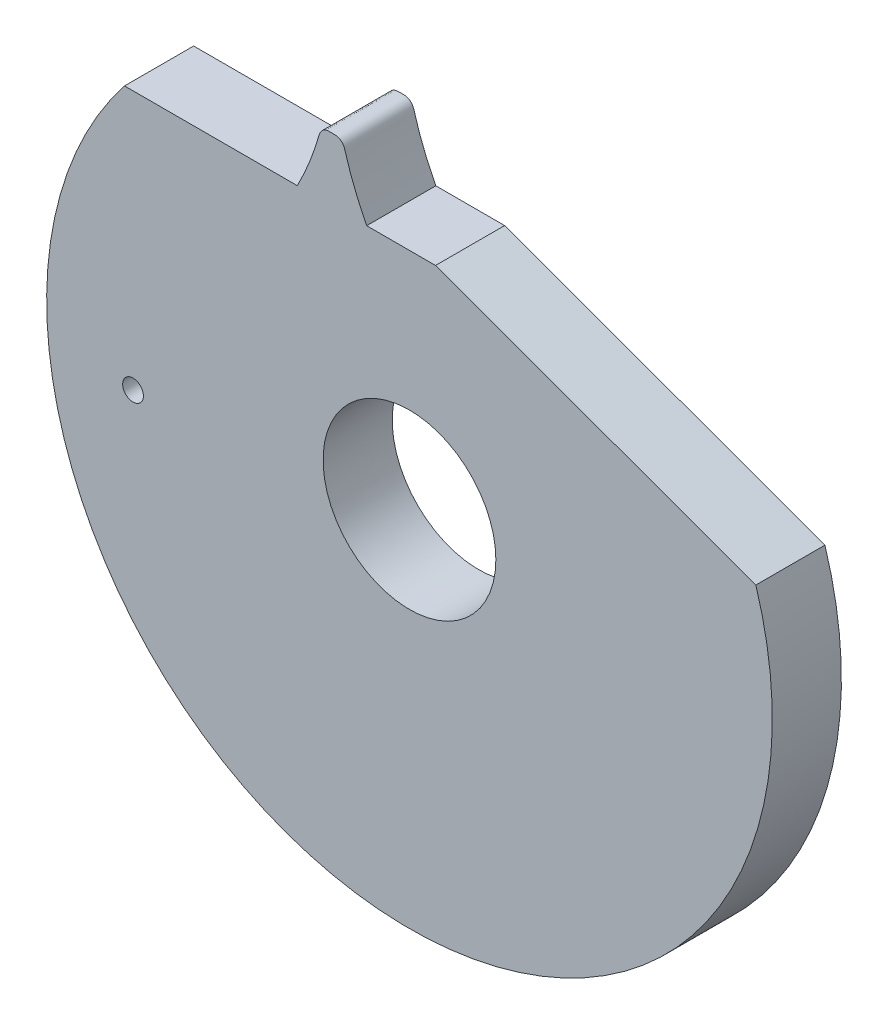
ISO-10303-21;
HEADER;
FILE_DESCRIPTION(('STEP AP214'),'2;1');
FILE_NAME('part.step','',(''),(''),'','','');
FILE_SCHEMA(('AUTOMOTIVE_DESIGN { 1 0 10303 214 1 1 1 1 }'));
ENDSEC;
DATA;
#1=APPLICATION_CONTEXT('core data for automotive mechanical design processes');
#2=APPLICATION_PROTOCOL_DEFINITION('international standard','automotive_design',2000,#1);
#3=PRODUCT_CONTEXT('',#1,'mechanical');
#4=PRODUCT('Part','Part','',(#3));
#5=PRODUCT_RELATED_PRODUCT_CATEGORY('part','',(#4));
#6=PRODUCT_DEFINITION_FORMATION('','',#4);
#7=PRODUCT_DEFINITION_CONTEXT('part definition',#1,'design');
#8=PRODUCT_DEFINITION('design','',#6,#7);
#9=PRODUCT_DEFINITION_SHAPE('','',#8);
#10=(LENGTH_UNIT() NAMED_UNIT(*) SI_UNIT(.MILLI.,.METRE.));
#11=(NAMED_UNIT(*) PLANE_ANGLE_UNIT() SI_UNIT($,.RADIAN.));
#12=(NAMED_UNIT(*) SI_UNIT($,.STERADIAN.) SOLID_ANGLE_UNIT());
#13=UNCERTAINTY_MEASURE_WITH_UNIT(LENGTH_MEASURE(1.E-05),#10,'distance_accuracy_value','');
#14=(GEOMETRIC_REPRESENTATION_CONTEXT(3) GLOBAL_UNCERTAINTY_ASSIGNED_CONTEXT((#13)) GLOBAL_UNIT_ASSIGNED_CONTEXT((#10,
#11,#12)) REPRESENTATION_CONTEXT('',''));
#15=CARTESIAN_POINT('',(0.,0.,0.));
#16=DIRECTION('',(0.,0.,1.));
#17=DIRECTION('',(1.,0.,0.));
#18=AXIS2_PLACEMENT_3D('',#15,#16,#17);
#19=CARTESIAN_POINT('',(-0.560560129400888,2.07992567827172,0.5));
#20=DIRECTION('',(0.,0.,-1.));
#21=DIRECTION('',(-1.,0.,0.));
#22=AXIS2_PLACEMENT_3D('',#19,#20,#21);
#23=PLANE('',#22);
#24=CARTESIAN_POINT('',(0.,0.,0.5));
#25=DIRECTION('',(0.,0.,1.));
#26=DIRECTION('',(1.,0.,0.));
#27=AXIS2_PLACEMENT_3D('',#24,#25,#26);
#28=CIRCLE('',#27,0.625);
#29=CARTESIAN_POINT('',(0.625,0.,0.5));
#30=VERTEX_POINT('',#29);
#31=EDGE_CURVE('E116',#30,#30,#28,.T.);
#32=ORIENTED_EDGE('',*,*,#31,.F.);
#33=EDGE_LOOP('',(#32));
#34=FACE_BOUND('',#33,.T.);
#35=CARTESIAN_POINT('',(-0.309567445992937,1.625,0.5));
#36=CARTESIAN_POINT('',(-0.322337903018578,1.64995934930982,0.5));
#37=CARTESIAN_POINT('',(-0.338622020565531,1.68309087865979,0.5));
#38=CARTESIAN_POINT('',(-0.35777313286631,1.7244231603822,0.5));
#39=CARTESIAN_POINT('',(-0.36840810968514,1.74806485199601,0.5));
#40=CARTESIAN_POINT('',(-0.378496488941134,1.77117838096723,0.5));
#41=CARTESIAN_POINT('',(-0.388051433653411,1.79375455928541,0.5));
#42=CARTESIAN_POINT('',(-0.397086252348211,1.81578443212939,0.5));
#43=CARTESIAN_POINT('',(-0.405614380501074,1.8372592751375,0.5));
#44=CARTESIAN_POINT('',(-0.413649395880378,1.85817059330962,0.5));
#45=CARTESIAN_POINT('',(-0.421204956877051,1.87851013821923,0.5));
#46=CARTESIAN_POINT('',(-0.428295003470919,1.89826985361319,0.5));
#47=CARTESIAN_POINT('',(-0.434933028025355,1.91744207676664,0.5));
#48=CARTESIAN_POINT('',(-0.441134643880046,1.93601883222484,0.5));
#49=CARTESIAN_POINT('',(-0.446908480166645,1.953994338277,0.5));
#50=CARTESIAN_POINT('',(-0.452288320773321,1.97135616236044,0.5));
#51=CARTESIAN_POINT('',(-0.457709999111133,1.98978229839919,0.5));
#52=CARTESIAN_POINT('',(-0.461829216383996,2.00376157330081,0.5));
#53=CARTESIAN_POINT('',(-0.464382168712026,2.01359325376766,0.5));
#54=CARTESIAN_POINT('',(-0.465582908789986,2.01765593246769,0.5));
#55=CARTESIAN_POINT('',(-0.466877066839506,2.02167416661449,0.5));
#56=CARTESIAN_POINT('',(-0.468293534704594,2.02566287292413,0.5));
#57=CARTESIAN_POINT('',(-0.469851220014418,2.02964414127735,0.5));
#58=CARTESIAN_POINT('',(-0.471580695855447,2.0336424151051,0.5));
#59=CARTESIAN_POINT('',(-0.473521601000363,2.03768594156605,0.5));
#60=CARTESIAN_POINT('',(-0.47572772760842,2.04180590116188,0.5));
#61=CARTESIAN_POINT('',(-0.47827146638032,2.04603482702129,0.5));
#62=CARTESIAN_POINT('',(-0.481249978189814,2.05040257909694,0.5));
#63=CARTESIAN_POINT('',(-0.484791874836422,2.05492815242703,0.5));
#64=CARTESIAN_POINT('',(-0.489062458870084,2.05960434758713,0.5));
#65=CARTESIAN_POINT('',(-0.494262133878477,2.06437232821557,0.5));
#66=CARTESIAN_POINT('',(-0.50060726050232,2.06908401040865,0.5));
#67=CARTESIAN_POINT('',(-0.508278836120168,2.07346637086148,0.5));
#68=CARTESIAN_POINT('',(-0.517327269196836,2.0770926129763,0.5));
#69=CARTESIAN_POINT('',(-0.527245490372485,2.0794312431513,0.5));
#70=CARTESIAN_POINT('',(-0.541824753831042,2.08034754096189,0.5));
#71=CARTESIAN_POINT('',(-0.560560129400889,2.07963200688566,0.5));
#72=CARTESIAN_POINT('',(-0.579295504970736,2.08034754096189,0.5));
#73=CARTESIAN_POINT('',(-0.593874768429294,2.0794312431513,0.5));
#74=CARTESIAN_POINT('',(-0.603792989604942,2.0770926129763,0.5));
#75=CARTESIAN_POINT('',(-0.61284142268161,2.07346637086148,0.5));
#76=CARTESIAN_POINT('',(-0.620512998299459,2.06908401040865,0.5));
#77=CARTESIAN_POINT('',(-0.6268581249233,2.06437232821558,0.5));
#78=CARTESIAN_POINT('',(-0.632057799931697,2.05960434758714,0.5));
#79=CARTESIAN_POINT('',(-0.636328383965352,2.05492815242702,0.5));
#80=CARTESIAN_POINT('',(-0.63987028061197,2.05040257909694,0.5));
#81=CARTESIAN_POINT('',(-0.642848792421458,2.04603482702129,0.5));
#82=CARTESIAN_POINT('',(-0.645392531193359,2.04180590116188,0.5));
#83=CARTESIAN_POINT('',(-0.647598657801414,2.03768594156605,0.5));
#84=CARTESIAN_POINT('',(-0.649539562946333,2.0336424151051,0.5));
#85=CARTESIAN_POINT('',(-0.651269038787359,2.02964414127735,0.5));
#86=CARTESIAN_POINT('',(-0.652826724097191,2.02566287292414,0.5));
#87=CARTESIAN_POINT('',(-0.654243191962271,2.02167416661449,0.5));
#88=CARTESIAN_POINT('',(-0.655537350011793,2.01765593246769,0.5));
#89=CARTESIAN_POINT('',(-0.656738090089753,2.01359325376767,0.5));
#90=CARTESIAN_POINT('',(-0.659291042417784,2.00376157330082,0.5));
#91=CARTESIAN_POINT('',(-0.663410259690648,1.98978229839919,0.5));
#92=CARTESIAN_POINT('',(-0.66883193802845,1.97135616236044,0.5));
#93=CARTESIAN_POINT('',(-0.67421177863514,1.953994338277,0.5));
#94=CARTESIAN_POINT('',(-0.679985614921724,1.93601883222484,0.5));
#95=CARTESIAN_POINT('',(-0.686187230776425,1.91744207676663,0.5));
#96=CARTESIAN_POINT('',(-0.692825255330861,1.89826985361319,0.5));
#97=CARTESIAN_POINT('',(-0.699915301924726,1.87851013821923,0.5));
#98=CARTESIAN_POINT('',(-0.707470862921397,1.85817059330961,0.5));
#99=CARTESIAN_POINT('',(-0.715505878300701,1.83725927513749,0.5));
#100=CARTESIAN_POINT('',(-0.724034006453567,1.81578443212938,0.5));
#101=CARTESIAN_POINT('',(-0.733068825148353,1.7937545592854,0.5));
#102=CARTESIAN_POINT('',(-0.742623769860647,1.77117838096723,0.5));
#103=CARTESIAN_POINT('',(-0.752712149116627,1.74806485199601,0.5));
#104=CARTESIAN_POINT('',(-0.763347125935458,1.7244231603822,0.5));
#105=CARTESIAN_POINT('',(-0.782498238236236,1.68309087865979,0.5));
#106=CARTESIAN_POINT('',(-0.798782355783188,1.64995934930982,0.5));
#107=CARTESIAN_POINT('',(-0.811552812808832,1.625,0.5));
#108=B_SPLINE_CURVE_WITH_KNOTS('',3,(#35,#36,#37,#38,#39,#40,#41,#42,#43,#44,#45,#46,#47,#48,
#49,#50,#51,#52,#53,#54,#55,#56,#57,#58,#59,#60,#61,#62,#63,#64,#65,#66,#67,#68,#69,#70,#71,#72,
#73,#74,#75,#76,#77,#78,#79,#80,#81,#82,#83,#84,#85,#86,#87,#88,#89,#90,#91,#92,#93,#94,#95,#96,
#97,#98,#99,#100,#101,#102,#103,#104,#105,#106,#107),.UNSPECIFIED.,.F.,.F.,(4,1,1,1,1,1,1,1,1,1,
1,1,1,1,1,1,1,1,1,1,1,1,1,1,1,1,1,1,1,1,1,1,1,1,1,1,1,1,1,1,1,1,1,1,1,1,1,1,1,1,1,1,1,1,1,1,1,1,
1,1,1,1,1,1,1,1,1,1,1,1,4),(0.,0.0766434706907742,0.100907917309995,0.124530540841739,
0.147511341286021,0.16985031864285,0.191547472912244,0.212602804094209,0.233016312188767,
0.252787997195939,0.271917859115733,0.290405897948182,0.308252113693299,0.325456506351118,
0.34201907592166,0.357939822404965,0.377966123851803,0.381853223429495,0.385706750251701,
0.389545590933468,0.393392716060458,0.397276239563091,0.401230769159746,0.405299107363362,
0.409534341124745,0.414002283313193,0.4187840362205,0.423978013917385,0.42969988880457,
0.436077404659656,0.443234951367286,0.451261729603674,0.460161640974881,0.469798585148513,
0.478975881094316,0.5,0.521024118905687,0.53020141485149,0.539838359025121,0.548738270396328,
0.556765048632712,0.563922595340345,0.57030011119543,0.576021986082618,0.581215963779502,
0.585997716686808,0.590465658875256,0.594700892636639,0.598769230840255,0.60272376043691,
0.606607283939544,0.610454409066533,0.614293249748303,0.618146776570508,0.622033876148198,
0.642060177595036,0.657980924078343,0.674543493648883,0.69174788630671,0.709594102051831,
0.728082140884274,0.747212002804071,0.766983687811239,0.787397195905797,0.808452527087764,
0.830149681357157,0.852488658713985,0.875469459158265,0.899092082690012,0.923356529309232,1.),.UNSPECIFIED.);
#109=CARTESIAN_POINT('',(-0.309567445992937,1.625,0.5));
#110=VERTEX_POINT('',#109);
#111=CARTESIAN_POINT('',(-0.811552812808832,1.625,0.5));
#112=VERTEX_POINT('',#111);
#113=EDGE_CURVE('E124',#110,#112,#108,.T.);
#114=ORIENTED_EDGE('',*,*,#113,.T.);
#115=DIRECTION('',(-1.,0.,0.));
#116=VECTOR('',#115,1.);
#117=CARTESIAN_POINT('',(-2.06155281280883,1.625,0.5));
#118=LINE('',#117,#116);
#119=CARTESIAN_POINT('',(-2.06155281280883,1.625,0.5));
#120=VERTEX_POINT('',#119);
#121=EDGE_CURVE('E86',#112,#120,#118,.T.);
#122=ORIENTED_EDGE('',*,*,#121,.T.);
#123=CARTESIAN_POINT('',(0.,0.,0.5));
#124=DIRECTION('',(0.,0.,1.));
#125=DIRECTION('',(1.,0.,0.));
#126=AXIS2_PLACEMENT_3D('',#123,#124,#125);
#127=CIRCLE('',#126,2.625);
#128=CARTESIAN_POINT('',(2.50597262834034,0.781489722267049,0.5));
#129=VERTEX_POINT('',#128);
#130=EDGE_CURVE('E90',#120,#129,#127,.T.);
#131=ORIENTED_EDGE('',*,*,#130,.T.);
#132=DIRECTION('',(-0.939692620785908,0.34202014332567,0.));
#133=VECTOR('',#132,1.);
#134=CARTESIAN_POINT('',(0.188447187191166,1.625,0.5));
#135=LINE('',#134,#133);
#136=CARTESIAN_POINT('',(0.188447187191166,1.625,0.5));
#137=VERTEX_POINT('',#136);
#138=EDGE_CURVE('E94',#129,#137,#135,.T.);
#139=ORIENTED_EDGE('',*,*,#138,.T.);
#140=DIRECTION('',(-1.,0.,0.));
#141=VECTOR('',#140,1.);
#142=CARTESIAN_POINT('',(-0.309567445992937,1.625,0.5));
#143=LINE('',#142,#141);
#144=EDGE_CURVE('E52',#137,#110,#143,.T.);
#145=ORIENTED_EDGE('',*,*,#144,.T.);
#146=EDGE_LOOP('',(#114,#122,#131,#139,#145));
#147=FACE_BOUND('',#146,.T.);
#148=CARTESIAN_POINT('',(-2.,-0.250000000000002,0.5));
#149=DIRECTION('',(0.,0.,1.));
#150=DIRECTION('',(1.,0.,0.));
#151=AXIS2_PLACEMENT_3D('',#148,#149,#150);
#152=CIRCLE('',#151,0.075);
#153=CARTESIAN_POINT('',(-1.925,-0.250000000000002,0.5));
#154=VERTEX_POINT('',#153);
#155=EDGE_CURVE('E162',#154,#154,#152,.T.);
#156=ORIENTED_EDGE('',*,*,#155,.F.);
#157=EDGE_LOOP('',(#156));
#158=FACE_BOUND('',#157,.T.);
#159=ADVANCED_FACE('F34',(#34,#147,#158),#23,.F.);
#160=CARTESIAN_POINT('',(-0.560560129400888,2.07992567827172,0.));
#161=DIRECTION('',(0.,0.,-1.));
#162=DIRECTION('',(-1.,0.,0.));
#163=AXIS2_PLACEMENT_3D('',#160,#161,#162);
#164=PLANE('',#163);
#165=CARTESIAN_POINT('',(0.,0.,0.));
#166=DIRECTION('',(0.,0.,1.));
#167=DIRECTION('',(1.,0.,0.));
#168=AXIS2_PLACEMENT_3D('',#165,#166,#167);
#169=CIRCLE('',#168,0.625);
#170=CARTESIAN_POINT('',(0.625,0.,0.));
#171=VERTEX_POINT('',#170);
#172=EDGE_CURVE('E167',#171,#171,#169,.T.);
#173=ORIENTED_EDGE('',*,*,#172,.T.);
#174=EDGE_LOOP('',(#173));
#175=FACE_BOUND('',#174,.T.);
#176=CARTESIAN_POINT('',(-0.309567445992937,1.625,0.));
#177=CARTESIAN_POINT('',(-0.322337903018578,1.64995934930982,0.));
#178=CARTESIAN_POINT('',(-0.33862202056553,1.68309087865979,0.));
#179=CARTESIAN_POINT('',(-0.35777313286631,1.7244231603822,0.));
#180=CARTESIAN_POINT('',(-0.36840810968514,1.74806485199601,0.));
#181=CARTESIAN_POINT('',(-0.378496488941135,1.77117838096723,0.));
#182=CARTESIAN_POINT('',(-0.388051433653411,1.79375455928541,0.));
#183=CARTESIAN_POINT('',(-0.397086252348211,1.81578443212939,0.));
#184=CARTESIAN_POINT('',(-0.405614380501074,1.8372592751375,0.));
#185=CARTESIAN_POINT('',(-0.413649395880379,1.85817059330962,0.));
#186=CARTESIAN_POINT('',(-0.421204956877051,1.87851013821923,0.));
#187=CARTESIAN_POINT('',(-0.42829500347092,1.89826985361319,0.));
#188=CARTESIAN_POINT('',(-0.434933028025354,1.91744207676664,0.));
#189=CARTESIAN_POINT('',(-0.441134643880047,1.93601883222484,0.));
#190=CARTESIAN_POINT('',(-0.446908480166645,1.953994338277,0.));
#191=CARTESIAN_POINT('',(-0.452288320773321,1.97135616236044,0.));
#192=CARTESIAN_POINT('',(-0.457709999111133,1.98978229839919,0.));
#193=CARTESIAN_POINT('',(-0.461829216383996,2.00376157330081,0.));
#194=CARTESIAN_POINT('',(-0.464382168712026,2.01359325376766,0.));
#195=CARTESIAN_POINT('',(-0.465582908789986,2.01765593246769,0.));
#196=CARTESIAN_POINT('',(-0.466877066839507,2.02167416661449,0.));
#197=CARTESIAN_POINT('',(-0.468293534704594,2.02566287292413,0.));
#198=CARTESIAN_POINT('',(-0.469851220014418,2.02964414127735,0.));
#199=CARTESIAN_POINT('',(-0.471580695855446,2.0336424151051,0.));
#200=CARTESIAN_POINT('',(-0.473521601000363,2.03768594156605,0.));
#201=CARTESIAN_POINT('',(-0.47572772760842,2.04180590116188,0.));
#202=CARTESIAN_POINT('',(-0.47827146638032,2.04603482702129,0.));
#203=CARTESIAN_POINT('',(-0.481249978189814,2.05040257909694,0.));
#204=CARTESIAN_POINT('',(-0.484791874836423,2.05492815242703,0.));
#205=CARTESIAN_POINT('',(-0.489062458870084,2.05960434758713,0.));
#206=CARTESIAN_POINT('',(-0.494262133878477,2.06437232821557,0.));
#207=CARTESIAN_POINT('',(-0.500607260502319,2.06908401040865,0.));
#208=CARTESIAN_POINT('',(-0.508278836120168,2.07346637086148,0.));
#209=CARTESIAN_POINT('',(-0.517327269196836,2.0770926129763,0.));
#210=CARTESIAN_POINT('',(-0.527245490372485,2.0794312431513,0.));
#211=CARTESIAN_POINT('',(-0.541824753831043,2.08034754096189,0.));
#212=CARTESIAN_POINT('',(-0.560560129400888,2.07963200688566,0.));
#213=CARTESIAN_POINT('',(-0.579295504970736,2.08034754096189,0.));
#214=CARTESIAN_POINT('',(-0.593874768429294,2.0794312431513,0.));
#215=CARTESIAN_POINT('',(-0.603792989604942,2.0770926129763,0.));
#216=CARTESIAN_POINT('',(-0.61284142268161,2.07346637086148,0.));
#217=CARTESIAN_POINT('',(-0.620512998299458,2.06908401040865,0.));
#218=CARTESIAN_POINT('',(-0.6268581249233,2.06437232821558,0.));
#219=CARTESIAN_POINT('',(-0.632057799931697,2.05960434758714,0.));
#220=CARTESIAN_POINT('',(-0.636328383965352,2.05492815242702,0.));
#221=CARTESIAN_POINT('',(-0.639870280611971,2.05040257909694,0.));
#222=CARTESIAN_POINT('',(-0.642848792421457,2.04603482702129,0.));
#223=CARTESIAN_POINT('',(-0.645392531193359,2.04180590116188,0.));
#224=CARTESIAN_POINT('',(-0.647598657801415,2.03768594156605,0.));
#225=CARTESIAN_POINT('',(-0.649539562946332,2.0336424151051,0.));
#226=CARTESIAN_POINT('',(-0.65126903878736,2.02964414127735,0.));
#227=CARTESIAN_POINT('',(-0.652826724097191,2.02566287292414,0.));
#228=CARTESIAN_POINT('',(-0.654243191962272,2.02167416661449,0.));
#229=CARTESIAN_POINT('',(-0.655537350011793,2.01765593246769,0.));
#230=CARTESIAN_POINT('',(-0.656738090089753,2.01359325376767,0.));
#231=CARTESIAN_POINT('',(-0.659291042417784,2.00376157330082,0.));
#232=CARTESIAN_POINT('',(-0.663410259690648,1.98978229839919,0.));
#233=CARTESIAN_POINT('',(-0.668831938028451,1.97135616236044,0.));
#234=CARTESIAN_POINT('',(-0.67421177863514,1.953994338277,0.));
#235=CARTESIAN_POINT('',(-0.679985614921725,1.93601883222484,0.));
#236=CARTESIAN_POINT('',(-0.686187230776424,1.91744207676663,0.));
#237=CARTESIAN_POINT('',(-0.692825255330861,1.89826985361319,0.));
#238=CARTESIAN_POINT('',(-0.699915301924727,1.87851013821923,0.));
#239=CARTESIAN_POINT('',(-0.707470862921397,1.85817059330961,0.));
#240=CARTESIAN_POINT('',(-0.715505878300702,1.83725927513749,0.));
#241=CARTESIAN_POINT('',(-0.724034006453567,1.81578443212938,0.));
#242=CARTESIAN_POINT('',(-0.733068825148352,1.7937545592854,0.));
#243=CARTESIAN_POINT('',(-0.742623769860647,1.77117838096723,0.));
#244=CARTESIAN_POINT('',(-0.752712149116627,1.74806485199601,0.));
#245=CARTESIAN_POINT('',(-0.763347125935458,1.7244231603822,0.));
#246=CARTESIAN_POINT('',(-0.782498238236238,1.68309087865978,0.));
#247=CARTESIAN_POINT('',(-0.798782355783187,1.64995934930982,0.));
#248=CARTESIAN_POINT('',(-0.811552812808832,1.625,0.));
#249=B_SPLINE_CURVE_WITH_KNOTS('',3,(#176,#177,#178,#179,#180,#181,#182,#183,#184,#185,#186,
#187,#188,#189,#190,#191,#192,#193,#194,#195,#196,#197,#198,#199,#200,#201,#202,#203,#204,#205,
#206,#207,#208,#209,#210,#211,#212,#213,#214,#215,#216,#217,#218,#219,#220,#221,#222,#223,#224,
#225,#226,#227,#228,#229,#230,#231,#232,#233,#234,#235,#236,#237,#238,#239,#240,#241,#242,#243,
#244,#245,#246,#247,#248),.UNSPECIFIED.,.F.,.F.,(4,1,1,1,1,1,1,1,1,1,1,1,1,1,1,1,1,1,1,1,1,1,1,
1,1,1,1,1,1,1,1,1,1,1,1,1,1,1,1,1,1,1,1,1,1,1,1,1,1,1,1,1,1,1,1,1,1,1,1,1,1,1,1,1,1,1,1,1,1,1,
4),(0.,0.0766434706907742,0.100907917309995,0.124530540841739,0.147511341286021,
0.16985031864285,0.191547472912244,0.212602804094209,0.233016312188767,0.252787997195939,
0.271917859115733,0.290405897948182,0.308252113693299,0.325456506351118,0.34201907592166,
0.357939822404965,0.377966123851803,0.381853223429495,0.385706750251701,0.389545590933468,
0.393392716060458,0.397276239563091,0.401230769159746,0.405299107363362,0.409534341124745,
0.414002283313193,0.4187840362205,0.423978013917385,0.42969988880457,0.436077404659656,
0.443234951367286,0.451261729603674,0.460161640974881,0.469798585148513,0.478975881094316,0.5,
0.521024118905687,0.53020141485149,0.539838359025121,0.548738270396328,0.556765048632712,
0.563922595340345,0.57030011119543,0.576021986082618,0.581215963779502,0.585997716686808,
0.590465658875256,0.594700892636639,0.598769230840255,0.60272376043691,0.606607283939544,
0.610454409066533,0.614293249748303,0.618146776570508,0.622033876148198,0.642060177595036,
0.657980924078343,0.674543493648883,0.69174788630671,0.709594102051831,0.728082140884274,
0.747212002804071,0.766983687811239,0.787397195905797,0.808452527087764,0.830149681357157,
0.852488658713985,0.875469459158265,0.899092082690012,0.923356529309232,1.),.UNSPECIFIED.);
#250=CARTESIAN_POINT('',(-0.309567445992937,1.625,0.));
#251=VERTEX_POINT('',#250);
#252=CARTESIAN_POINT('',(-0.811552812808832,1.625,0.));
#253=VERTEX_POINT('',#252);
#254=EDGE_CURVE('E110',#251,#253,#249,.T.);
#255=ORIENTED_EDGE('',*,*,#254,.F.);
#256=DIRECTION('',(-1.,0.,0.));
#257=VECTOR('',#256,1.);
#258=CARTESIAN_POINT('',(-0.309567445992937,1.625,0.));
#259=LINE('',#258,#257);
#260=CARTESIAN_POINT('',(0.188447187191167,1.625,0.));
#261=VERTEX_POINT('',#260);
#262=EDGE_CURVE('E78',#261,#251,#259,.T.);
#263=ORIENTED_EDGE('',*,*,#262,.F.);
#264=DIRECTION('',(-0.939692620785908,0.34202014332567,0.));
#265=VECTOR('',#264,1.);
#266=CARTESIAN_POINT('',(0.188447187191167,1.625,0.));
#267=LINE('',#266,#265);
#268=CARTESIAN_POINT('',(2.50597262834034,0.78148972226705,0.));
#269=VERTEX_POINT('',#268);
#270=EDGE_CURVE('E72',#269,#261,#267,.T.);
#271=ORIENTED_EDGE('',*,*,#270,.F.);
#272=CARTESIAN_POINT('',(0.,0.,0.));
#273=DIRECTION('',(0.,0.,1.));
#274=DIRECTION('',(1.,0.,0.));
#275=AXIS2_PLACEMENT_3D('',#272,#273,#274);
#276=CIRCLE('',#275,2.625);
#277=CARTESIAN_POINT('',(-2.06155281280883,1.62499999999999,0.));
#278=VERTEX_POINT('',#277);
#279=EDGE_CURVE('E101',#278,#269,#276,.T.);
#280=ORIENTED_EDGE('',*,*,#279,.F.);
#281=DIRECTION('',(-1.,0.,0.));
#282=VECTOR('',#281,1.);
#283=CARTESIAN_POINT('',(-2.06155281280883,1.62499999999999,0.));
#284=LINE('',#283,#282);
#285=EDGE_CURVE('E115',#253,#278,#284,.T.);
#286=ORIENTED_EDGE('',*,*,#285,.F.);
#287=EDGE_LOOP('',(#255,#263,#271,#280,#286));
#288=FACE_BOUND('',#287,.T.);
#289=CARTESIAN_POINT('',(-2.,-0.250000000000002,0.));
#290=DIRECTION('',(0.,0.,1.));
#291=DIRECTION('',(1.,0.,0.));
#292=AXIS2_PLACEMENT_3D('',#289,#290,#291);
#293=CIRCLE('',#292,0.075);
#294=CARTESIAN_POINT('',(-1.925,-0.250000000000002,0.));
#295=VERTEX_POINT('',#294);
#296=EDGE_CURVE('E165',#295,#295,#293,.T.);
#297=ORIENTED_EDGE('',*,*,#296,.T.);
#298=EDGE_LOOP('',(#297));
#299=FACE_BOUND('',#298,.T.);
#300=ADVANCED_FACE('F128',(#175,#288,#299),#164,.T.);
#301=DIRECTION('',(0.,0.,-1.));
#302=VECTOR('',#301,1.);
#303=SURFACE_OF_LINEAR_EXTRUSION('',#108,#302);
#304=ORIENTED_EDGE('',*,*,#254,.T.);
#305=DIRECTION('',(0.,0.,-1.));
#306=VECTOR('',#305,1.);
#307=CARTESIAN_POINT('',(-0.811552812808832,1.625,0.5));
#308=LINE('',#307,#306);
#309=EDGE_CURVE('E11',#112,#253,#308,.T.);
#310=ORIENTED_EDGE('',*,*,#309,.F.);
#311=ORIENTED_EDGE('',*,*,#113,.F.);
#312=DIRECTION('',(0.,0.,-1.));
#313=VECTOR('',#312,1.);
#314=CARTESIAN_POINT('',(-0.309567445992937,1.625,0.5));
#315=LINE('',#314,#313);
#316=EDGE_CURVE('E106',#110,#251,#315,.T.);
#317=ORIENTED_EDGE('',*,*,#316,.T.);
#318=EDGE_LOOP('',(#304,#310,#311,#317));
#319=FACE_BOUND('',#318,.T.);
#320=ADVANCED_FACE('F36',(#319),#303,.F.);
#321=CARTESIAN_POINT('',(-2.06155281280883,1.625,0.5));
#322=DIRECTION('',(0.,-1.,0.));
#323=DIRECTION('',(1.,0.,0.));
#324=AXIS2_PLACEMENT_3D('',#321,#322,#323);
#325=PLANE('',#324);
#326=ORIENTED_EDGE('',*,*,#285,.T.);
#327=DIRECTION('',(0.,0.,-1.));
#328=VECTOR('',#327,1.);
#329=CARTESIAN_POINT('',(-2.06155281280883,1.625,0.5));
#330=LINE('',#329,#328);
#331=EDGE_CURVE('E44',#120,#278,#330,.T.);
#332=ORIENTED_EDGE('',*,*,#331,.F.);
#333=ORIENTED_EDGE('',*,*,#121,.F.);
#334=ORIENTED_EDGE('',*,*,#309,.T.);
#335=EDGE_LOOP('',(#326,#332,#333,#334));
#336=FACE_BOUND('',#335,.T.);
#337=ADVANCED_FACE('F205',(#336),#325,.F.);
#338=CARTESIAN_POINT('',(0.,0.,0.5));
#339=DIRECTION('',(0.,0.,-1.));
#340=DIRECTION('',(-1.,0.,0.));
#341=AXIS2_PLACEMENT_3D('',#338,#339,#340);
#342=CYLINDRICAL_SURFACE('',#341,2.625);
#343=ORIENTED_EDGE('',*,*,#279,.T.);
#344=DIRECTION('',(0.,0.,-1.));
#345=VECTOR('',#344,1.);
#346=CARTESIAN_POINT('',(2.50597262834034,0.781489722267049,0.5));
#347=LINE('',#346,#345);
#348=EDGE_CURVE('E98',#129,#269,#347,.T.);
#349=ORIENTED_EDGE('',*,*,#348,.F.);
#350=ORIENTED_EDGE('',*,*,#130,.F.);
#351=ORIENTED_EDGE('',*,*,#331,.T.);
#352=EDGE_LOOP('',(#343,#349,#350,#351));
#353=FACE_BOUND('',#352,.T.);
#354=ADVANCED_FACE('F99',(#353),#342,.T.);
#355=CARTESIAN_POINT('',(0.188447187191166,1.625,0.5));
#356=DIRECTION('',(-0.342020143325669,-0.939692620785908,0.));
#357=DIRECTION('',(0.939692620785908,-0.342020143325669,0.));
#358=AXIS2_PLACEMENT_3D('',#355,#356,#357);
#359=PLANE('',#358);
#360=ORIENTED_EDGE('',*,*,#270,.T.);
#361=DIRECTION('',(0.,0.,-1.));
#362=VECTOR('',#361,1.);
#363=CARTESIAN_POINT('',(0.188447187191166,1.625,0.5));
#364=LINE('',#363,#362);
#365=EDGE_CURVE('E102',#137,#261,#364,.T.);
#366=ORIENTED_EDGE('',*,*,#365,.F.);
#367=ORIENTED_EDGE('',*,*,#138,.F.);
#368=ORIENTED_EDGE('',*,*,#348,.T.);
#369=EDGE_LOOP('',(#360,#366,#367,#368));
#370=FACE_BOUND('',#369,.T.);
#371=ADVANCED_FACE('F104',(#370),#359,.F.);
#372=CARTESIAN_POINT('',(-0.309567445992937,1.625,0.5));
#373=DIRECTION('',(0.,-1.,0.));
#374=DIRECTION('',(0.,0.,-1.));
#375=AXIS2_PLACEMENT_3D('',#372,#373,#374);
#376=PLANE('',#375);
#377=ORIENTED_EDGE('',*,*,#262,.T.);
#378=ORIENTED_EDGE('',*,*,#316,.F.);
#379=ORIENTED_EDGE('',*,*,#144,.F.);
#380=ORIENTED_EDGE('',*,*,#365,.T.);
#381=EDGE_LOOP('',(#377,#378,#379,#380));
#382=FACE_BOUND('',#381,.T.);
#383=ADVANCED_FACE('F133',(#382),#376,.F.);
#384=CARTESIAN_POINT('',(0.,0.,0.5));
#385=DIRECTION('',(0.,0.,-1.));
#386=DIRECTION('',(-1.,0.,0.));
#387=AXIS2_PLACEMENT_3D('',#384,#385,#386);
#388=CYLINDRICAL_SURFACE('',#387,0.625);
#389=ORIENTED_EDGE('',*,*,#31,.T.);
#390=EDGE_LOOP('',(#389));
#391=FACE_BOUND('',#390,.T.);
#392=ORIENTED_EDGE('',*,*,#172,.F.);
#393=EDGE_LOOP('',(#392));
#394=FACE_BOUND('',#393,.T.);
#395=ADVANCED_FACE('F135',(#391,#394),#388,.F.);
#396=CARTESIAN_POINT('',(-2.,-0.250000000000002,0.5));
#397=DIRECTION('',(0.,0.,-1.));
#398=DIRECTION('',(-1.,0.,0.));
#399=AXIS2_PLACEMENT_3D('',#396,#397,#398);
#400=CYLINDRICAL_SURFACE('',#399,0.075);
#401=ORIENTED_EDGE('',*,*,#155,.T.);
#402=EDGE_LOOP('',(#401));
#403=FACE_BOUND('',#402,.T.);
#404=ORIENTED_EDGE('',*,*,#296,.F.);
#405=EDGE_LOOP('',(#404));
#406=FACE_BOUND('',#405,.T.);
#407=ADVANCED_FACE('F141',(#403,#406),#400,.F.);
#408=CLOSED_SHELL('',(#159,#300,#320,#337,#354,#371,#383,#395,#407));
#409=MANIFOLD_SOLID_BREP('B2',#408);
#410=ADVANCED_BREP_SHAPE_REPRESENTATION('',(#18,#409),#14);
#411=SHAPE_DEFINITION_REPRESENTATION(#9,#410);
ENDSEC;
END-ISO-10303-21;
